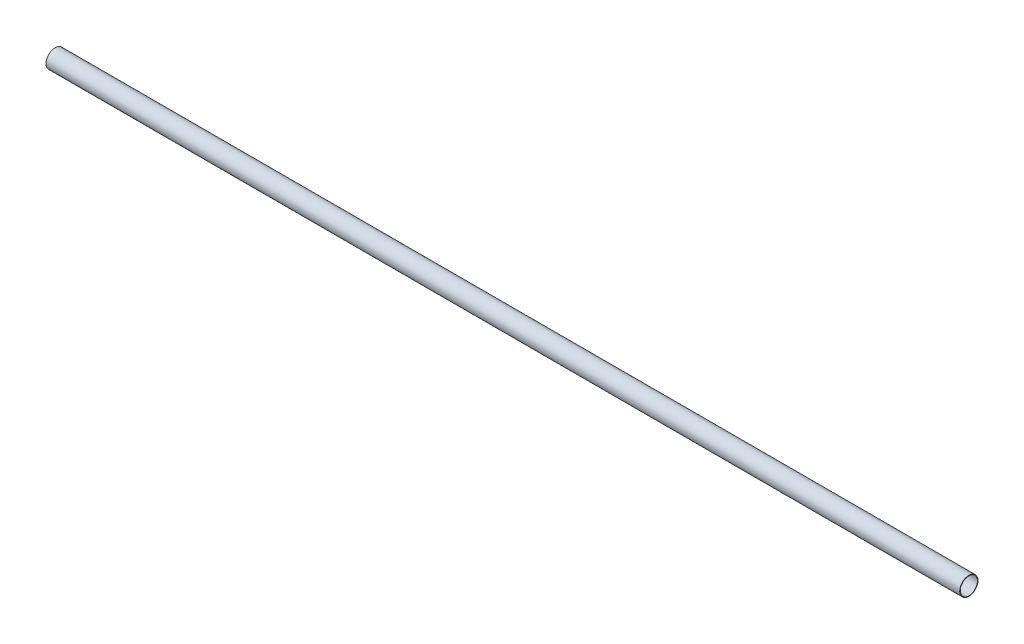
ISO-10303-21;
HEADER;
FILE_DESCRIPTION(('STEP AP214'),'2;1');
FILE_NAME('part.step','',(''),(''),'','','');
FILE_SCHEMA(('AUTOMOTIVE_DESIGN { 1 0 10303 214 1 1 1 1 }'));
ENDSEC;
DATA;
#1=APPLICATION_CONTEXT('core data for automotive mechanical design processes');
#2=APPLICATION_PROTOCOL_DEFINITION('international standard','automotive_design',2000,#1);
#3=PRODUCT_CONTEXT('',#1,'mechanical');
#4=PRODUCT('Part','Part','',(#3));
#5=PRODUCT_RELATED_PRODUCT_CATEGORY('part','',(#4));
#6=PRODUCT_DEFINITION_FORMATION('','',#4);
#7=PRODUCT_DEFINITION_CONTEXT('part definition',#1,'design');
#8=PRODUCT_DEFINITION('design','',#6,#7);
#9=PRODUCT_DEFINITION_SHAPE('','',#8);
#10=(LENGTH_UNIT() NAMED_UNIT(*) SI_UNIT(.MILLI.,.METRE.));
#11=(NAMED_UNIT(*) PLANE_ANGLE_UNIT() SI_UNIT($,.RADIAN.));
#12=(NAMED_UNIT(*) SI_UNIT($,.STERADIAN.) SOLID_ANGLE_UNIT());
#13=UNCERTAINTY_MEASURE_WITH_UNIT(LENGTH_MEASURE(1.E-05),#10,'distance_accuracy_value','');
#14=(GEOMETRIC_REPRESENTATION_CONTEXT(3) GLOBAL_UNCERTAINTY_ASSIGNED_CONTEXT((#13)) GLOBAL_UNIT_ASSIGNED_CONTEXT((#10,
#11,#12)) REPRESENTATION_CONTEXT('',''));
#15=CARTESIAN_POINT('',(0.,0.,0.));
#16=DIRECTION('',(0.,0.,1.));
#17=DIRECTION('',(1.,0.,0.));
#18=AXIS2_PLACEMENT_3D('',#15,#16,#17);
#19=CARTESIAN_POINT('',(2500.,0.,0.));
#20=DIRECTION('',(1.,0.,0.));
#21=DIRECTION('',(0.,0.,-1.));
#22=AXIS2_PLACEMENT_3D('',#19,#20,#21);
#23=PLANE('',#22);
#24=CARTESIAN_POINT('',(2500.,0.,0.));
#25=DIRECTION('',(1.,0.,0.));
#26=DIRECTION('',(0.,0.,-1.));
#27=AXIS2_PLACEMENT_3D('',#24,#25,#26);
#28=CIRCLE('',#27,25.);
#29=CARTESIAN_POINT('',(2500.,0.,-25.));
#30=VERTEX_POINT('',#29);
#31=EDGE_CURVE('E10',#30,#30,#28,.T.);
#32=ORIENTED_EDGE('',*,*,#31,.T.);
#33=EDGE_LOOP('',(#32));
#34=FACE_BOUND('',#33,.T.);
#35=CARTESIAN_POINT('',(2500.,0.,0.));
#36=DIRECTION('',(1.,0.,0.));
#37=DIRECTION('',(0.,0.,-1.));
#38=AXIS2_PLACEMENT_3D('',#35,#36,#37);
#39=CIRCLE('',#38,23.5);
#40=CARTESIAN_POINT('',(2500.,0.,-23.5));
#41=VERTEX_POINT('',#40);
#42=EDGE_CURVE('E50',#41,#41,#39,.T.);
#43=ORIENTED_EDGE('',*,*,#42,.F.);
#44=EDGE_LOOP('',(#43));
#45=FACE_BOUND('',#44,.T.);
#46=ADVANCED_FACE('F37',(#34,#45),#23,.T.);
#47=CARTESIAN_POINT('',(0.,0.,0.));
#48=DIRECTION('',(1.,0.,0.));
#49=DIRECTION('',(0.,0.,-1.));
#50=AXIS2_PLACEMENT_3D('',#47,#48,#49);
#51=PLANE('',#50);
#52=CARTESIAN_POINT('',(0.,0.,0.));
#53=DIRECTION('',(1.,0.,0.));
#54=DIRECTION('',(0.,0.,-1.));
#55=AXIS2_PLACEMENT_3D('',#52,#53,#54);
#56=CIRCLE('',#55,25.);
#57=CARTESIAN_POINT('',(0.,0.,-25.));
#58=VERTEX_POINT('',#57);
#59=EDGE_CURVE('E41',#58,#58,#56,.T.);
#60=ORIENTED_EDGE('',*,*,#59,.F.);
#61=EDGE_LOOP('',(#60));
#62=FACE_BOUND('',#61,.T.);
#63=CARTESIAN_POINT('',(0.,0.,0.));
#64=DIRECTION('',(1.,0.,0.));
#65=DIRECTION('',(0.,0.,-1.));
#66=AXIS2_PLACEMENT_3D('',#63,#64,#65);
#67=CIRCLE('',#66,23.5);
#68=CARTESIAN_POINT('',(0.,0.,-23.5));
#69=VERTEX_POINT('',#68);
#70=EDGE_CURVE('E52',#69,#69,#67,.T.);
#71=ORIENTED_EDGE('',*,*,#70,.T.);
#72=EDGE_LOOP('',(#71));
#73=FACE_BOUND('',#72,.T.);
#74=ADVANCED_FACE('F64',(#62,#73),#51,.F.);
#75=CARTESIAN_POINT('',(2500.,0.,0.));
#76=DIRECTION('',(-1.,0.,0.));
#77=DIRECTION('',(0.,0.,1.));
#78=AXIS2_PLACEMENT_3D('',#75,#76,#77);
#79=CYLINDRICAL_SURFACE('',#78,25.);
#80=ORIENTED_EDGE('',*,*,#31,.F.);
#81=EDGE_LOOP('',(#80));
#82=FACE_BOUND('',#81,.T.);
#83=ORIENTED_EDGE('',*,*,#59,.T.);
#84=EDGE_LOOP('',(#83));
#85=FACE_BOUND('',#84,.T.);
#86=ADVANCED_FACE('F39',(#82,#85),#79,.T.);
#87=CARTESIAN_POINT('',(2500.,0.,0.));
#88=DIRECTION('',(-1.,0.,0.));
#89=DIRECTION('',(0.,0.,1.));
#90=AXIS2_PLACEMENT_3D('',#87,#88,#89);
#91=CYLINDRICAL_SURFACE('',#90,23.5);
#92=ORIENTED_EDGE('',*,*,#42,.T.);
#93=EDGE_LOOP('',(#92));
#94=FACE_BOUND('',#93,.T.);
#95=ORIENTED_EDGE('',*,*,#70,.F.);
#96=EDGE_LOOP('',(#95));
#97=FACE_BOUND('',#96,.T.);
#98=ADVANCED_FACE('F60',(#94,#97),#91,.F.);
#99=CLOSED_SHELL('',(#46,#74,#86,#98));
#100=MANIFOLD_SOLID_BREP('B2',#99);
#101=ADVANCED_BREP_SHAPE_REPRESENTATION('',(#18,#100),#14);
#102=SHAPE_DEFINITION_REPRESENTATION(#9,#101);
ENDSEC;
END-ISO-10303-21;
